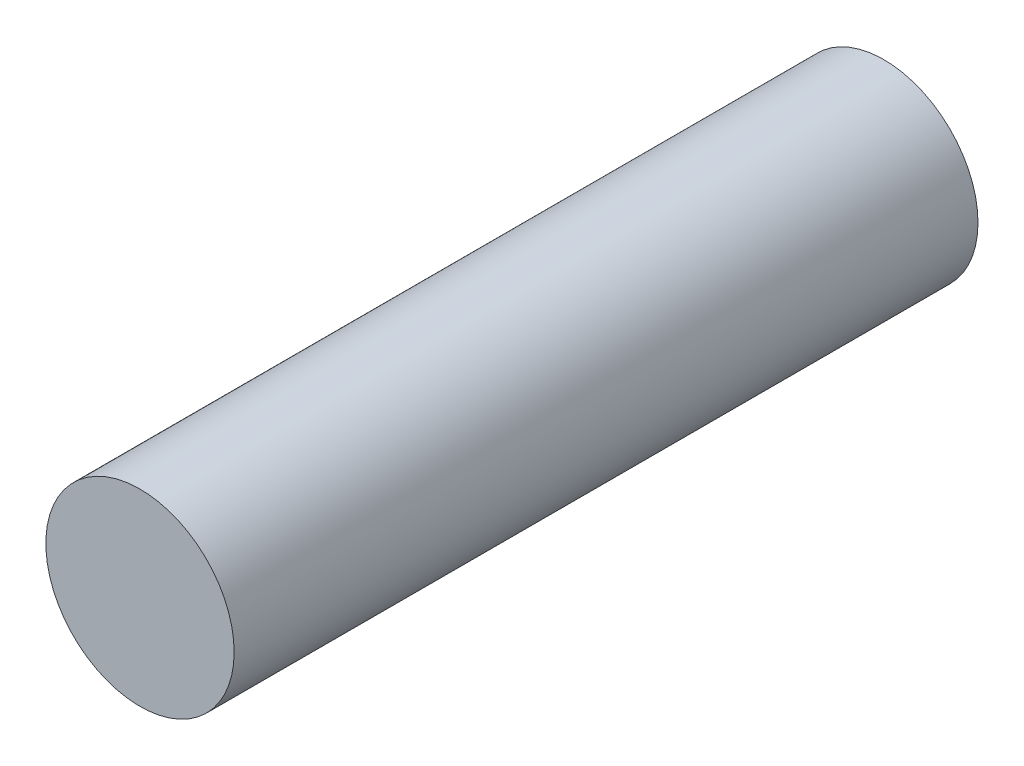
ISO-10303-21;
HEADER;
FILE_DESCRIPTION(('STEP AP214'),'2;1');
FILE_NAME('part.step','',(''),(''),'','','');
FILE_SCHEMA(('AUTOMOTIVE_DESIGN { 1 0 10303 214 1 1 1 1 }'));
ENDSEC;
DATA;
#1=APPLICATION_CONTEXT('core data for automotive mechanical design processes');
#2=APPLICATION_PROTOCOL_DEFINITION('international standard','automotive_design',2000,#1);
#3=PRODUCT_CONTEXT('',#1,'mechanical');
#4=PRODUCT('Part','Part','',(#3));
#5=PRODUCT_RELATED_PRODUCT_CATEGORY('part','',(#4));
#6=PRODUCT_DEFINITION_FORMATION('','',#4);
#7=PRODUCT_DEFINITION_CONTEXT('part definition',#1,'design');
#8=PRODUCT_DEFINITION('design','',#6,#7);
#9=PRODUCT_DEFINITION_SHAPE('','',#8);
#10=(LENGTH_UNIT() NAMED_UNIT(*) SI_UNIT(.MILLI.,.METRE.));
#11=(NAMED_UNIT(*) PLANE_ANGLE_UNIT() SI_UNIT($,.RADIAN.));
#12=(NAMED_UNIT(*) SI_UNIT($,.STERADIAN.) SOLID_ANGLE_UNIT());
#13=UNCERTAINTY_MEASURE_WITH_UNIT(LENGTH_MEASURE(1.E-05),#10,'distance_accuracy_value','');
#14=(GEOMETRIC_REPRESENTATION_CONTEXT(3) GLOBAL_UNCERTAINTY_ASSIGNED_CONTEXT((#13)) GLOBAL_UNIT_ASSIGNED_CONTEXT((#10,
#11,#12)) REPRESENTATION_CONTEXT('',''));
#15=CARTESIAN_POINT('',(0.,0.,0.));
#16=DIRECTION('',(0.,0.,1.));
#17=DIRECTION('',(1.,0.,0.));
#18=AXIS2_PLACEMENT_3D('',#15,#16,#17);
#19=CARTESIAN_POINT('',(-10.0165574589457,-10.0165574589457,30.));
#20=DIRECTION('',(0.,0.,-1.));
#21=DIRECTION('',(-1.,0.,0.));
#22=AXIS2_PLACEMENT_3D('',#19,#20,#21);
#23=CYLINDRICAL_SURFACE('',#22,3.79708670005155);
#24=CARTESIAN_POINT('',(-10.0165574589457,-10.0165574589457,30.));
#25=DIRECTION('',(0.,0.,1.));
#26=DIRECTION('',(1.,0.,0.));
#27=AXIS2_PLACEMENT_3D('',#24,#25,#26);
#28=CIRCLE('',#27,3.79708670005155);
#29=CARTESIAN_POINT('',(-6.21947075889412,-10.0165574589457,30.));
#30=VERTEX_POINT('',#29);
#31=EDGE_CURVE('E10',#30,#30,#28,.T.);
#32=ORIENTED_EDGE('',*,*,#31,.F.);
#33=EDGE_LOOP('',(#32));
#34=FACE_BOUND('',#33,.T.);
#35=CARTESIAN_POINT('',(-10.0165574589457,-10.0165574589457,0.));
#36=DIRECTION('',(0.,0.,1.));
#37=DIRECTION('',(1.,0.,0.));
#38=AXIS2_PLACEMENT_3D('',#35,#36,#37);
#39=CIRCLE('',#38,3.79708670005155);
#40=CARTESIAN_POINT('',(-6.21947075889412,-10.0165574589457,0.));
#41=VERTEX_POINT('',#40);
#42=EDGE_CURVE('E33',#41,#41,#39,.T.);
#43=ORIENTED_EDGE('',*,*,#42,.T.);
#44=EDGE_LOOP('',(#43));
#45=FACE_BOUND('',#44,.T.);
#46=ADVANCED_FACE('F30',(#34,#45),#23,.T.);
#47=CARTESIAN_POINT('',(-10.0165574589457,-10.0165574589457,30.));
#48=DIRECTION('',(0.,0.,1.));
#49=DIRECTION('',(1.,0.,0.));
#50=AXIS2_PLACEMENT_3D('',#47,#48,#49);
#51=PLANE('',#50);
#52=ORIENTED_EDGE('',*,*,#31,.T.);
#53=EDGE_LOOP('',(#52));
#54=FACE_BOUND('',#53,.T.);
#55=ADVANCED_FACE('F45',(#54),#51,.T.);
#56=CARTESIAN_POINT('',(-10.0165574589457,-10.0165574589457,0.));
#57=DIRECTION('',(0.,0.,1.));
#58=DIRECTION('',(1.,0.,0.));
#59=AXIS2_PLACEMENT_3D('',#56,#57,#58);
#60=PLANE('',#59);
#61=ORIENTED_EDGE('',*,*,#42,.F.);
#62=EDGE_LOOP('',(#61));
#63=FACE_BOUND('',#62,.T.);
#64=ADVANCED_FACE('F43',(#63),#60,.F.);
#65=CLOSED_SHELL('',(#46,#55,#64));
#66=MANIFOLD_SOLID_BREP('B2',#65);
#67=ADVANCED_BREP_SHAPE_REPRESENTATION('',(#18,#66),#14);
#68=SHAPE_DEFINITION_REPRESENTATION(#9,#67);
ENDSEC;
END-ISO-10303-21;
